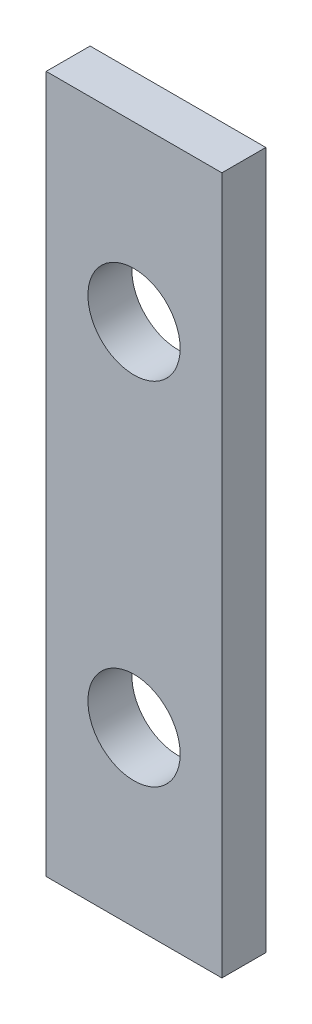
ISO-10303-21;
HEADER;
FILE_DESCRIPTION(('STEP AP214'),'2;1');
FILE_NAME('part.step','',(''),(''),'','','');
FILE_SCHEMA(('AUTOMOTIVE_DESIGN { 1 0 10303 214 1 1 1 1 }'));
ENDSEC;
DATA;
#1=APPLICATION_CONTEXT('core data for automotive mechanical design processes');
#2=APPLICATION_PROTOCOL_DEFINITION('international standard','automotive_design',2000,#1);
#3=PRODUCT_CONTEXT('',#1,'mechanical');
#4=PRODUCT('Part','Part','',(#3));
#5=PRODUCT_RELATED_PRODUCT_CATEGORY('part','',(#4));
#6=PRODUCT_DEFINITION_FORMATION('','',#4);
#7=PRODUCT_DEFINITION_CONTEXT('part definition',#1,'design');
#8=PRODUCT_DEFINITION('design','',#6,#7);
#9=PRODUCT_DEFINITION_SHAPE('','',#8);
#10=(LENGTH_UNIT() NAMED_UNIT(*) SI_UNIT(.MILLI.,.METRE.));
#11=(NAMED_UNIT(*) PLANE_ANGLE_UNIT() SI_UNIT($,.RADIAN.));
#12=(NAMED_UNIT(*) SI_UNIT($,.STERADIAN.) SOLID_ANGLE_UNIT());
#13=UNCERTAINTY_MEASURE_WITH_UNIT(LENGTH_MEASURE(1.E-05),#10,'distance_accuracy_value','');
#14=(GEOMETRIC_REPRESENTATION_CONTEXT(3) GLOBAL_UNCERTAINTY_ASSIGNED_CONTEXT((#13)) GLOBAL_UNIT_ASSIGNED_CONTEXT((#10,
#11,#12)) REPRESENTATION_CONTEXT('',''));
#15=CARTESIAN_POINT('',(0.,0.,0.));
#16=DIRECTION('',(0.,0.,1.));
#17=DIRECTION('',(1.,0.,0.));
#18=AXIS2_PLACEMENT_3D('',#15,#16,#17);
#19=CARTESIAN_POINT('',(6.28203235397994,31.75,-2.50725613483571));
#20=DIRECTION('',(-1.,0.,0.));
#21=DIRECTION('',(0.,0.,1.));
#22=AXIS2_PLACEMENT_3D('',#19,#20,#21);
#23=PLANE('',#22);
#24=DIRECTION('',(0.,0.,-1.));
#25=VECTOR('',#24,1.);
#26=CARTESIAN_POINT('',(6.28203235397994,0.,-2.50725613483571));
#27=LINE('',#26,#25);
#28=CARTESIAN_POINT('',(6.28203235397994,0.,-2.50725613483571));
#29=VERTEX_POINT('',#28);
#30=CARTESIAN_POINT('',(6.28203235397994,0.,-4.50725613483571));
#31=VERTEX_POINT('',#30);
#32=EDGE_CURVE('E117',#29,#31,#27,.T.);
#33=ORIENTED_EDGE('',*,*,#32,.T.);
#34=DIRECTION('',(0.,-1.,0.));
#35=VECTOR('',#34,1.);
#36=CARTESIAN_POINT('',(6.28203235397994,31.75,-4.50725613483571));
#37=LINE('',#36,#35);
#38=CARTESIAN_POINT('',(6.28203235397994,31.75,-4.50725613483571));
#39=VERTEX_POINT('',#38);
#40=EDGE_CURVE('E11',#39,#31,#37,.T.);
#41=ORIENTED_EDGE('',*,*,#40,.F.);
#42=DIRECTION('',(0.,0.,-1.));
#43=VECTOR('',#42,1.);
#44=CARTESIAN_POINT('',(6.28203235397994,31.75,-2.50725613483571));
#45=LINE('',#44,#43);
#46=CARTESIAN_POINT('',(6.28203235397994,31.75,-2.50725613483571));
#47=VERTEX_POINT('',#46);
#48=EDGE_CURVE('E100',#47,#39,#45,.T.);
#49=ORIENTED_EDGE('',*,*,#48,.F.);
#50=DIRECTION('',(0.,-1.,0.));
#51=VECTOR('',#50,1.);
#52=CARTESIAN_POINT('',(6.28203235397994,31.75,-2.50725613483571));
#53=LINE('',#52,#51);
#54=EDGE_CURVE('E113',#47,#29,#53,.T.);
#55=ORIENTED_EDGE('',*,*,#54,.T.);
#56=EDGE_LOOP('',(#33,#41,#49,#55));
#57=FACE_BOUND('',#56,.T.);
#58=ADVANCED_FACE('F40',(#57),#23,.F.);
#59=CARTESIAN_POINT('',(6.28203235397994,31.75,-4.50725613483571));
#60=DIRECTION('',(0.,0.,1.));
#61=DIRECTION('',(1.,0.,0.));
#62=AXIS2_PLACEMENT_3D('',#59,#60,#61);
#63=PLANE('',#62);
#64=CARTESIAN_POINT('',(2.28203235397688,7.87500000000101,-4.50725613483571));
#65=DIRECTION('',(0.,0.,1.));
#66=DIRECTION('',(1.,0.,0.));
#67=AXIS2_PLACEMENT_3D('',#64,#65,#66);
#68=CIRCLE('',#67,2.1);
#69=CARTESIAN_POINT('',(4.38203235397688,7.87500000000101,-4.50725613483571));
#70=VERTEX_POINT('',#69);
#71=EDGE_CURVE('E121',#70,#70,#68,.T.);
#72=ORIENTED_EDGE('',*,*,#71,.T.);
#73=EDGE_LOOP('',(#72));
#74=FACE_BOUND('',#73,.T.);
#75=CARTESIAN_POINT('',(2.28203235397696,23.875000000001,-4.50725613483571));
#76=DIRECTION('',(0.,0.,1.));
#77=DIRECTION('',(1.,0.,0.));
#78=AXIS2_PLACEMENT_3D('',#75,#76,#77);
#79=CIRCLE('',#78,2.1);
#80=CARTESIAN_POINT('',(4.38203235397696,23.875000000001,-4.50725613483571));
#81=VERTEX_POINT('',#80);
#82=EDGE_CURVE('E141',#81,#81,#79,.T.);
#83=ORIENTED_EDGE('',*,*,#82,.T.);
#84=EDGE_LOOP('',(#83));
#85=FACE_BOUND('',#84,.T.);
#86=DIRECTION('',(-1.,0.,0.));
#87=VECTOR('',#86,1.);
#88=CARTESIAN_POINT('',(6.28203235397994,0.,-4.50725613483571));
#89=LINE('',#88,#87);
#90=CARTESIAN_POINT('',(-1.71796764602006,0.,-4.50725613483571));
#91=VERTEX_POINT('',#90);
#92=EDGE_CURVE('E105',#31,#91,#89,.T.);
#93=ORIENTED_EDGE('',*,*,#92,.T.);
#94=DIRECTION('',(0.,-1.,0.));
#95=VECTOR('',#94,1.);
#96=CARTESIAN_POINT('',(-1.71796764602006,31.75,-4.50725613483571));
#97=LINE('',#96,#95);
#98=CARTESIAN_POINT('',(-1.71796764602006,31.75,-4.50725613483571));
#99=VERTEX_POINT('',#98);
#100=EDGE_CURVE('E49',#99,#91,#97,.T.);
#101=ORIENTED_EDGE('',*,*,#100,.F.);
#102=DIRECTION('',(-1.,0.,0.));
#103=VECTOR('',#102,1.);
#104=CARTESIAN_POINT('',(6.28203235397994,31.75,-4.50725613483571));
#105=LINE('',#104,#103);
#106=EDGE_CURVE('E94',#39,#99,#105,.T.);
#107=ORIENTED_EDGE('',*,*,#106,.F.);
#108=ORIENTED_EDGE('',*,*,#40,.T.);
#109=EDGE_LOOP('',(#93,#101,#107,#108));
#110=FACE_BOUND('',#109,.T.);
#111=ADVANCED_FACE('F104',(#74,#85,#110),#63,.F.);
#112=CARTESIAN_POINT('',(-1.71796764602006,31.75,-2.50725613483571));
#113=DIRECTION('',(1.,0.,0.));
#114=DIRECTION('',(0.,0.,-1.));
#115=AXIS2_PLACEMENT_3D('',#112,#113,#114);
#116=PLANE('',#115);
#117=DIRECTION('',(0.,0.,1.));
#118=VECTOR('',#117,1.);
#119=CARTESIAN_POINT('',(-1.71796764602006,0.,-2.50725613483571));
#120=LINE('',#119,#118);
#121=CARTESIAN_POINT('',(-1.71796764602006,0.,-2.50725613483571));
#122=VERTEX_POINT('',#121);
#123=EDGE_CURVE('E80',#91,#122,#120,.T.);
#124=ORIENTED_EDGE('',*,*,#123,.T.);
#125=DIRECTION('',(0.,-1.,0.));
#126=VECTOR('',#125,1.);
#127=CARTESIAN_POINT('',(-1.71796764602006,31.75,-2.50725613483571));
#128=LINE('',#127,#126);
#129=CARTESIAN_POINT('',(-1.71796764602006,31.75,-2.50725613483571));
#130=VERTEX_POINT('',#129);
#131=EDGE_CURVE('E107',#130,#122,#128,.T.);
#132=ORIENTED_EDGE('',*,*,#131,.F.);
#133=DIRECTION('',(0.,0.,1.));
#134=VECTOR('',#133,1.);
#135=CARTESIAN_POINT('',(-1.71796764602006,31.75,-2.50725613483571));
#136=LINE('',#135,#134);
#137=EDGE_CURVE('E98',#99,#130,#136,.T.);
#138=ORIENTED_EDGE('',*,*,#137,.F.);
#139=ORIENTED_EDGE('',*,*,#100,.T.);
#140=EDGE_LOOP('',(#124,#132,#138,#139));
#141=FACE_BOUND('',#140,.T.);
#142=ADVANCED_FACE('F108',(#141),#116,.F.);
#143=CARTESIAN_POINT('',(6.28203235397994,31.75,-2.50725613483571));
#144=DIRECTION('',(0.,0.,-1.));
#145=DIRECTION('',(-1.,0.,0.));
#146=AXIS2_PLACEMENT_3D('',#143,#144,#145);
#147=PLANE('',#146);
#148=CARTESIAN_POINT('',(2.28203235397688,7.87500000000101,-2.50725613483571));
#149=DIRECTION('',(0.,0.,1.));
#150=DIRECTION('',(1.,0.,0.));
#151=AXIS2_PLACEMENT_3D('',#148,#149,#150);
#152=CIRCLE('',#151,2.1);
#153=CARTESIAN_POINT('',(4.38203235397688,7.87500000000101,-2.50725613483571));
#154=VERTEX_POINT('',#153);
#155=EDGE_CURVE('E145',#154,#154,#152,.T.);
#156=ORIENTED_EDGE('',*,*,#155,.F.);
#157=EDGE_LOOP('',(#156));
#158=FACE_BOUND('',#157,.T.);
#159=CARTESIAN_POINT('',(2.28203235397696,23.875000000001,-2.50725613483571));
#160=DIRECTION('',(0.,0.,1.));
#161=DIRECTION('',(1.,0.,0.));
#162=AXIS2_PLACEMENT_3D('',#159,#160,#161);
#163=CIRCLE('',#162,2.1);
#164=CARTESIAN_POINT('',(4.38203235397696,23.875000000001,-2.50725613483571));
#165=VERTEX_POINT('',#164);
#166=EDGE_CURVE('E137',#165,#165,#163,.T.);
#167=ORIENTED_EDGE('',*,*,#166,.F.);
#168=EDGE_LOOP('',(#167));
#169=FACE_BOUND('',#168,.T.);
#170=DIRECTION('',(1.,0.,0.));
#171=VECTOR('',#170,1.);
#172=CARTESIAN_POINT('',(6.28203235397994,0.,-2.50725613483571));
#173=LINE('',#172,#171);
#174=EDGE_CURVE('E87',#122,#29,#173,.T.);
#175=ORIENTED_EDGE('',*,*,#174,.T.);
#176=ORIENTED_EDGE('',*,*,#54,.F.);
#177=DIRECTION('',(1.,0.,0.));
#178=VECTOR('',#177,1.);
#179=CARTESIAN_POINT('',(6.28203235397994,31.75,-2.50725613483571));
#180=LINE('',#179,#178);
#181=EDGE_CURVE('E60',#130,#47,#180,.T.);
#182=ORIENTED_EDGE('',*,*,#181,.F.);
#183=ORIENTED_EDGE('',*,*,#131,.T.);
#184=EDGE_LOOP('',(#175,#176,#182,#183));
#185=FACE_BOUND('',#184,.T.);
#186=ADVANCED_FACE('F131',(#158,#169,#185),#147,.F.);
#187=CARTESIAN_POINT('',(0.,31.75,0.));
#188=DIRECTION('',(0.,1.,0.));
#189=DIRECTION('',(0.,0.,1.));
#190=AXIS2_PLACEMENT_3D('',#187,#188,#189);
#191=PLANE('',#190);
#192=ORIENTED_EDGE('',*,*,#48,.T.);
#193=ORIENTED_EDGE('',*,*,#106,.T.);
#194=ORIENTED_EDGE('',*,*,#137,.T.);
#195=ORIENTED_EDGE('',*,*,#181,.T.);
#196=EDGE_LOOP('',(#192,#193,#194,#195));
#197=FACE_BOUND('',#196,.T.);
#198=ADVANCED_FACE('F96',(#197),#191,.T.);
#199=CARTESIAN_POINT('',(0.,0.,0.));
#200=DIRECTION('',(0.,1.,0.));
#201=DIRECTION('',(0.,0.,1.));
#202=AXIS2_PLACEMENT_3D('',#199,#200,#201);
#203=PLANE('',#202);
#204=ORIENTED_EDGE('',*,*,#32,.F.);
#205=ORIENTED_EDGE('',*,*,#174,.F.);
#206=ORIENTED_EDGE('',*,*,#123,.F.);
#207=ORIENTED_EDGE('',*,*,#92,.F.);
#208=EDGE_LOOP('',(#204,#205,#206,#207));
#209=FACE_BOUND('',#208,.T.);
#210=ADVANCED_FACE('F134',(#209),#203,.F.);
#211=CARTESIAN_POINT('',(2.28203235397696,23.875000000001,-4.50725613483571));
#212=DIRECTION('',(0.,0.,1.));
#213=DIRECTION('',(1.,0.,0.));
#214=AXIS2_PLACEMENT_3D('',#211,#212,#213);
#215=CYLINDRICAL_SURFACE('',#214,2.1);
#216=ORIENTED_EDGE('',*,*,#82,.F.);
#217=EDGE_LOOP('',(#216));
#218=FACE_BOUND('',#217,.T.);
#219=ORIENTED_EDGE('',*,*,#166,.T.);
#220=EDGE_LOOP('',(#219));
#221=FACE_BOUND('',#220,.T.);
#222=ADVANCED_FACE('F158',(#218,#221),#215,.F.);
#223=CARTESIAN_POINT('',(2.28203235397688,7.87500000000101,-4.50725613483571));
#224=DIRECTION('',(0.,0.,1.));
#225=DIRECTION('',(1.,0.,0.));
#226=AXIS2_PLACEMENT_3D('',#223,#224,#225);
#227=CYLINDRICAL_SURFACE('',#226,2.1);
#228=ORIENTED_EDGE('',*,*,#71,.F.);
#229=EDGE_LOOP('',(#228));
#230=FACE_BOUND('',#229,.T.);
#231=ORIENTED_EDGE('',*,*,#155,.T.);
#232=EDGE_LOOP('',(#231));
#233=FACE_BOUND('',#232,.T.);
#234=ADVANCED_FACE('F155',(#230,#233),#227,.F.);
#235=CLOSED_SHELL('',(#58,#111,#142,#186,#198,#210,#222,#234));
#236=MANIFOLD_SOLID_BREP('B2',#235);
#237=ADVANCED_BREP_SHAPE_REPRESENTATION('',(#18,#236),#14);
#238=SHAPE_DEFINITION_REPRESENTATION(#9,#237);
ENDSEC;
END-ISO-10303-21;
